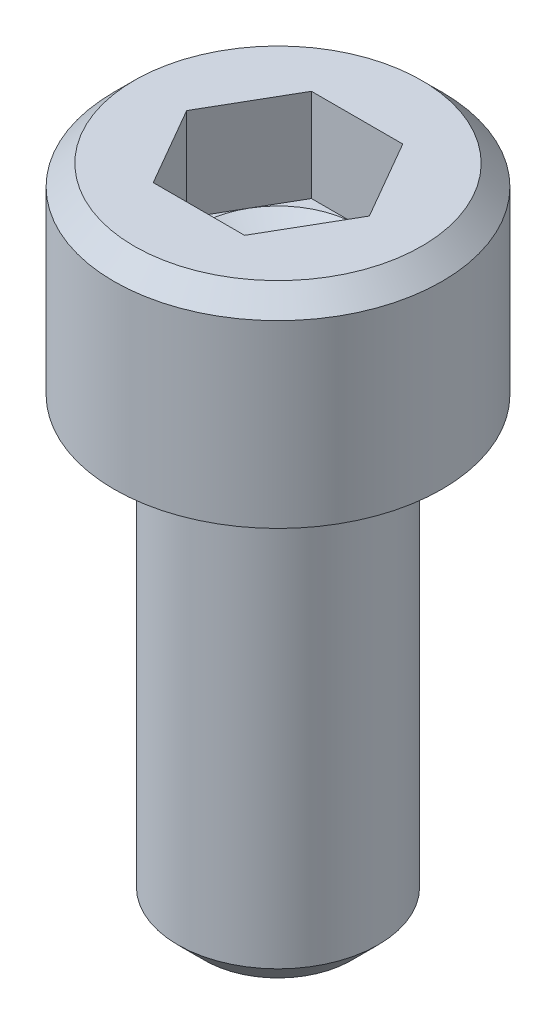
ISO-10303-21;
HEADER;
FILE_DESCRIPTION(('STEP AP214'),'2;1');
FILE_NAME('part.step','',(''),(''),'','','');
FILE_SCHEMA(('AUTOMOTIVE_DESIGN { 1 0 10303 214 1 1 1 1 }'));
ENDSEC;
DATA;
#1=APPLICATION_CONTEXT('core data for automotive mechanical design processes');
#2=APPLICATION_PROTOCOL_DEFINITION('international standard','automotive_design',2000,#1);
#3=PRODUCT_CONTEXT('',#1,'mechanical');
#4=PRODUCT('Part','Part','',(#3));
#5=PRODUCT_RELATED_PRODUCT_CATEGORY('part','',(#4));
#6=PRODUCT_DEFINITION_FORMATION('','',#4);
#7=PRODUCT_DEFINITION_CONTEXT('part definition',#1,'design');
#8=PRODUCT_DEFINITION('design','',#6,#7);
#9=PRODUCT_DEFINITION_SHAPE('','',#8);
#10=(LENGTH_UNIT() NAMED_UNIT(*) SI_UNIT(.MILLI.,.METRE.));
#11=(NAMED_UNIT(*) PLANE_ANGLE_UNIT() SI_UNIT($,.RADIAN.));
#12=(NAMED_UNIT(*) SI_UNIT($,.STERADIAN.) SOLID_ANGLE_UNIT());
#13=UNCERTAINTY_MEASURE_WITH_UNIT(LENGTH_MEASURE(1.E-05),#10,'distance_accuracy_value','');
#14=(GEOMETRIC_REPRESENTATION_CONTEXT(3) GLOBAL_UNCERTAINTY_ASSIGNED_CONTEXT((#13)) GLOBAL_UNIT_ASSIGNED_CONTEXT((#10,
#11,#12)) REPRESENTATION_CONTEXT('',''));
#15=CARTESIAN_POINT('',(0.,0.,0.));
#16=DIRECTION('',(0.,0.,1.));
#17=DIRECTION('',(1.,0.,0.));
#18=AXIS2_PLACEMENT_3D('',#15,#16,#17);
#19=CARTESIAN_POINT('',(0.,1.8796,0.));
#20=DIRECTION('',(0.,1.,0.));
#21=DIRECTION('',(0.,0.,1.));
#22=AXIS2_PLACEMENT_3D('',#19,#20,#21);
#23=PLANE('',#22);
#24=DIRECTION('',(0.5,0.,-0.866025403784439));
#25=VECTOR('',#24,1.);
#26=CARTESIAN_POINT('',(0.799225977639064,1.8796,1.38429999999992));
#27=LINE('',#26,#25);
#28=CARTESIAN_POINT('',(0.799225977639064,1.8796,1.38429999999992));
#29=VERTEX_POINT('',#28);
#30=CARTESIAN_POINT('',(1.19883896645866,1.87960000005181,0.692149999999922));
#31=VERTEX_POINT('',#30);
#32=EDGE_CURVE('E159',#29,#31,#27,.T.);
#33=ORIENTED_EDGE('',*,*,#32,.T.);
#34=CARTESIAN_POINT('',(0.,1.87960000005181,0.));
#35=DIRECTION('',(0.,-1.,0.));
#36=DIRECTION('',(1.,0.,0.));
#37=AXIS2_PLACEMENT_3D('',#34,#35,#36);
#38=CIRCLE('',#37,1.38429999998393);
#39=CARTESIAN_POINT('',(0.,1.87960000005181,1.38429999998393));
#40=VERTEX_POINT('',#39);
#41=EDGE_CURVE('E47',#31,#40,#38,.T.);
#42=ORIENTED_EDGE('',*,*,#41,.T.);
#43=DIRECTION('',(1.,0.,0.));
#44=VECTOR('',#43,1.);
#45=CARTESIAN_POINT('',(-0.799225977639255,1.8796,1.38429999999992));
#46=LINE('',#45,#44);
#47=EDGE_CURVE('E189',#40,#29,#46,.T.);
#48=ORIENTED_EDGE('',*,*,#47,.T.);
#49=EDGE_LOOP('',(#33,#42,#48));
#50=FACE_BOUND('',#49,.T.);
#51=ADVANCED_FACE('F32',(#50),#23,.T.);
#52=CARTESIAN_POINT('',(-0.799225977639255,1.8796,1.38429999999992));
#53=VERTEX_POINT('',#52);
#54=EDGE_CURVE('E279',#53,#40,#46,.T.);
#55=ORIENTED_EDGE('',*,*,#54,.T.);
#56=CARTESIAN_POINT('',(-1.19883896644491,1.87960000005181,0.692149999991913));
#57=VERTEX_POINT('',#56);
#58=EDGE_CURVE('E208',#40,#57,#38,.T.);
#59=ORIENTED_EDGE('',*,*,#58,.T.);
#60=DIRECTION('',(0.499999999999962,0.,0.866025403784461));
#61=VECTOR('',#60,1.);
#62=CARTESIAN_POINT('',(-1.59845195527835,1.8796,0.));
#63=LINE('',#62,#61);
#64=EDGE_CURVE('E168',#57,#53,#63,.T.);
#65=ORIENTED_EDGE('',*,*,#64,.T.);
#66=EDGE_LOOP('',(#55,#59,#65));
#67=FACE_BOUND('',#66,.T.);
#68=ADVANCED_FACE('F122',(#67),#23,.T.);
#69=CARTESIAN_POINT('',(-1.59845195527835,1.8796,0.));
#70=VERTEX_POINT('',#69);
#71=EDGE_CURVE('E169',#70,#57,#63,.T.);
#72=ORIENTED_EDGE('',*,*,#71,.T.);
#73=CARTESIAN_POINT('',(-1.19883896644488,1.87960000005181,-0.692149999991966));
#74=VERTEX_POINT('',#73);
#75=EDGE_CURVE('E282',#57,#74,#38,.T.);
#76=ORIENTED_EDGE('',*,*,#75,.T.);
#77=DIRECTION('',(-0.5,0.,0.866025403784439));
#78=VECTOR('',#77,1.);
#79=CARTESIAN_POINT('',(-0.799225977639255,1.8796,-1.38429999999987));
#80=LINE('',#79,#78);
#81=EDGE_CURVE('E164',#74,#70,#80,.T.);
#82=ORIENTED_EDGE('',*,*,#81,.T.);
#83=EDGE_LOOP('',(#72,#76,#82));
#84=FACE_BOUND('',#83,.T.);
#85=ADVANCED_FACE('F128',(#84),#23,.T.);
#86=CARTESIAN_POINT('',(-0.799225977639255,1.8796,-1.38429999999987));
#87=VERTEX_POINT('',#86);
#88=EDGE_CURVE('E165',#87,#74,#80,.T.);
#89=ORIENTED_EDGE('',*,*,#88,.T.);
#90=CARTESIAN_POINT('',(0.,1.87960000005181,-1.38429999998393));
#91=VERTEX_POINT('',#90);
#92=EDGE_CURVE('E285',#74,#91,#38,.T.);
#93=ORIENTED_EDGE('',*,*,#92,.T.);
#94=DIRECTION('',(-1.,0.,0.));
#95=VECTOR('',#94,1.);
#96=CARTESIAN_POINT('',(0.799225977638982,1.8796,-1.38429999999987));
#97=LINE('',#96,#95);
#98=EDGE_CURVE('E154',#91,#87,#97,.T.);
#99=ORIENTED_EDGE('',*,*,#98,.T.);
#100=EDGE_LOOP('',(#89,#93,#99));
#101=FACE_BOUND('',#100,.T.);
#102=ADVANCED_FACE('F143',(#101),#23,.T.);
#103=CARTESIAN_POINT('',(0.799225977638982,1.8796,-1.38429999999987));
#104=VERTEX_POINT('',#103);
#105=EDGE_CURVE('E157',#104,#91,#97,.T.);
#106=ORIENTED_EDGE('',*,*,#105,.T.);
#107=CARTESIAN_POINT('',(1.19883896644488,1.87960000005181,-0.692149999991966));
#108=VERTEX_POINT('',#107);
#109=EDGE_CURVE('E283',#91,#108,#38,.T.);
#110=ORIENTED_EDGE('',*,*,#109,.T.);
#111=DIRECTION('',(-0.5,0.,-0.866025403784439));
#112=VECTOR('',#111,1.);
#113=CARTESIAN_POINT('',(1.59845195527816,1.8796,0.));
#114=LINE('',#113,#112);
#115=EDGE_CURVE('E155',#108,#104,#114,.T.);
#116=ORIENTED_EDGE('',*,*,#115,.T.);
#117=EDGE_LOOP('',(#106,#110,#116));
#118=FACE_BOUND('',#117,.T.);
#119=ADVANCED_FACE('F134',(#118),#23,.T.);
#120=CARTESIAN_POINT('',(1.59845195527816,1.8796,0.));
#121=VERTEX_POINT('',#120);
#122=EDGE_CURVE('E147',#121,#108,#114,.T.);
#123=ORIENTED_EDGE('',*,*,#122,.T.);
#124=EDGE_CURVE('E148',#108,#31,#38,.T.);
#125=ORIENTED_EDGE('',*,*,#124,.T.);
#126=EDGE_CURVE('E150',#31,#121,#27,.T.);
#127=ORIENTED_EDGE('',*,*,#126,.T.);
#128=EDGE_LOOP('',(#123,#125,#127));
#129=FACE_BOUND('',#128,.T.);
#130=ADVANCED_FACE('F124',(#129),#23,.T.);
#131=CARTESIAN_POINT('',(0.,0.,0.));
#132=DIRECTION('',(0.,-1.,0.));
#133=DIRECTION('',(0.,0.,-1.));
#134=AXIS2_PLACEMENT_3D('',#131,#132,#133);
#135=PLANE('',#134);
#136=CARTESIAN_POINT('',(0.,0.,0.));
#137=DIRECTION('',(0.,-1.,0.));
#138=DIRECTION('',(0.,0.,-1.));
#139=AXIS2_PLACEMENT_3D('',#136,#137,#138);
#140=CIRCLE('',#139,2.0066);
#141=CARTESIAN_POINT('',(0.,0.,-2.0066));
#142=VERTEX_POINT('',#141);
#143=EDGE_CURVE('E11',#142,#142,#140,.F.);
#144=ORIENTED_EDGE('',*,*,#143,.T.);
#145=EDGE_LOOP('',(#144));
#146=FACE_BOUND('',#145,.T.);
#147=CARTESIAN_POINT('',(0.,0.,0.));
#148=DIRECTION('',(0.,-1.,0.));
#149=DIRECTION('',(0.,0.,-1.));
#150=AXIS2_PLACEMENT_3D('',#147,#148,#149);
#151=CIRCLE('',#150,2.8702);
#152=CARTESIAN_POINT('',(0.,0.,-2.8702));
#153=VERTEX_POINT('',#152);
#154=EDGE_CURVE('E192',#153,#153,#151,.T.);
#155=ORIENTED_EDGE('',*,*,#154,.T.);
#156=EDGE_LOOP('',(#155));
#157=FACE_BOUND('',#156,.T.);
#158=ADVANCED_FACE('F133',(#146,#157),#135,.T.);
#159=CARTESIAN_POINT('',(0.,3.5052,0.));
#160=DIRECTION('',(0.,-1.,0.));
#161=DIRECTION('',(0.,0.,-1.));
#162=AXIS2_PLACEMENT_3D('',#159,#160,#161);
#163=CYLINDRICAL_SURFACE('',#162,2.8702);
#164=CARTESIAN_POINT('',(0.,3.14959999998844,0.));
#165=DIRECTION('',(0.,1.,0.));
#166=DIRECTION('',(0.,0.,1.));
#167=AXIS2_PLACEMENT_3D('',#164,#165,#166);
#168=CIRCLE('',#167,2.8702);
#169=CARTESIAN_POINT('',(0.,3.14959999998844,2.8702));
#170=VERTEX_POINT('',#169);
#171=EDGE_CURVE('E211',#170,#170,#168,.F.);
#172=ORIENTED_EDGE('',*,*,#171,.T.);
#173=EDGE_LOOP('',(#172));
#174=FACE_BOUND('',#173,.T.);
#175=ORIENTED_EDGE('',*,*,#154,.F.);
#176=EDGE_LOOP('',(#175));
#177=FACE_BOUND('',#176,.T.);
#178=ADVANCED_FACE('F140',(#174,#177),#163,.T.);
#179=CARTESIAN_POINT('',(2.8702,3.5052,0.));
#180=DIRECTION('',(0.,1.,0.));
#181=DIRECTION('',(0.,0.,1.));
#182=AXIS2_PLACEMENT_3D('',#179,#180,#181);
#183=PLANE('',#182);
#184=CARTESIAN_POINT('',(0.,3.5052,0.));
#185=DIRECTION('',(0.,1.,0.));
#186=DIRECTION('',(0.,0.,1.));
#187=AXIS2_PLACEMENT_3D('',#184,#185,#186);
#188=CIRCLE('',#187,2.51459999998843);
#189=CARTESIAN_POINT('',(0.,3.5052,2.51459999998843));
#190=VERTEX_POINT('',#189);
#191=EDGE_CURVE('E214',#190,#190,#188,.T.);
#192=ORIENTED_EDGE('',*,*,#191,.T.);
#193=EDGE_LOOP('',(#192));
#194=FACE_BOUND('',#193,.T.);
#195=DIRECTION('',(1.,0.,0.));
#196=VECTOR('',#195,1.);
#197=CARTESIAN_POINT('',(-0.799225977639255,3.5052,1.38429999999992));
#198=LINE('',#197,#196);
#199=CARTESIAN_POINT('',(-0.799225977639255,3.5052,1.38429999999992));
#200=VERTEX_POINT('',#199);
#201=CARTESIAN_POINT('',(0.799225977639064,3.5052,1.38429999999992));
#202=VERTEX_POINT('',#201);
#203=EDGE_CURVE('E55',#200,#202,#198,.T.);
#204=ORIENTED_EDGE('',*,*,#203,.F.);
#205=DIRECTION('',(0.499999999999962,0.,0.866025403784461));
#206=VECTOR('',#205,1.);
#207=CARTESIAN_POINT('',(-1.59845195527835,3.5052,0.));
#208=LINE('',#207,#206);
#209=CARTESIAN_POINT('',(-1.59845195527835,3.5052,0.));
#210=VERTEX_POINT('',#209);
#211=EDGE_CURVE('E186',#210,#200,#208,.T.);
#212=ORIENTED_EDGE('',*,*,#211,.F.);
#213=DIRECTION('',(-0.5,0.,0.866025403784439));
#214=VECTOR('',#213,1.);
#215=CARTESIAN_POINT('',(-0.799225977639255,3.5052,-1.38429999999987));
#216=LINE('',#215,#214);
#217=CARTESIAN_POINT('',(-0.799225977639255,3.5052,-1.38429999999987));
#218=VERTEX_POINT('',#217);
#219=EDGE_CURVE('E183',#218,#210,#216,.T.);
#220=ORIENTED_EDGE('',*,*,#219,.F.);
#221=DIRECTION('',(-1.,0.,0.));
#222=VECTOR('',#221,1.);
#223=CARTESIAN_POINT('',(0.799225977638982,3.5052,-1.38429999999987));
#224=LINE('',#223,#222);
#225=CARTESIAN_POINT('',(0.799225977638982,3.5052,-1.38429999999987));
#226=VERTEX_POINT('',#225);
#227=EDGE_CURVE('E180',#226,#218,#224,.T.);
#228=ORIENTED_EDGE('',*,*,#227,.F.);
#229=DIRECTION('',(-0.5,0.,-0.866025403784439));
#230=VECTOR('',#229,1.);
#231=CARTESIAN_POINT('',(1.59845195527816,3.5052,0.));
#232=LINE('',#231,#230);
#233=CARTESIAN_POINT('',(1.59845195527816,3.5052,0.));
#234=VERTEX_POINT('',#233);
#235=EDGE_CURVE('E177',#234,#226,#232,.T.);
#236=ORIENTED_EDGE('',*,*,#235,.F.);
#237=DIRECTION('',(0.5,0.,-0.866025403784439));
#238=VECTOR('',#237,1.);
#239=CARTESIAN_POINT('',(0.799225977639064,3.5052,1.38429999999992));
#240=LINE('',#239,#238);
#241=EDGE_CURVE('E174',#202,#234,#240,.T.);
#242=ORIENTED_EDGE('',*,*,#241,.F.);
#243=EDGE_LOOP('',(#204,#212,#220,#228,#236,#242));
#244=FACE_BOUND('',#243,.T.);
#245=ADVANCED_FACE('F233',(#194,#244),#183,.T.);
#246=CARTESIAN_POINT('',(0.,-7.9375,0.));
#247=DIRECTION('',(0.,1.,0.));
#248=DIRECTION('',(0.,0.,1.));
#249=AXIS2_PLACEMENT_3D('',#246,#247,#248);
#250=CYLINDRICAL_SURFACE('',#249,1.7526);
#251=CARTESIAN_POINT('',(0.,-0.254,0.));
#252=DIRECTION('',(0.,-1.,0.));
#253=DIRECTION('',(0.,0.,-1.));
#254=AXIS2_PLACEMENT_3D('',#251,#252,#253);
#255=CIRCLE('',#254,1.7526);
#256=CARTESIAN_POINT('',(0.,-0.254,-1.7526));
#257=VERTEX_POINT('',#256);
#258=EDGE_CURVE('E40',#257,#257,#255,.T.);
#259=ORIENTED_EDGE('',*,*,#258,.T.);
#260=EDGE_LOOP('',(#259));
#261=FACE_BOUND('',#260,.T.);
#262=CARTESIAN_POINT('',(0.,-7.46505999996966,0.));
#263=DIRECTION('',(0.,-1.,0.));
#264=DIRECTION('',(0.,0.,-1.));
#265=AXIS2_PLACEMENT_3D('',#262,#263,#264);
#266=CIRCLE('',#265,1.7526);
#267=CARTESIAN_POINT('',(0.,-7.46505999996966,-1.7526));
#268=VERTEX_POINT('',#267);
#269=EDGE_CURVE('E207',#268,#268,#266,.F.);
#270=ORIENTED_EDGE('',*,*,#269,.T.);
#271=EDGE_LOOP('',(#270));
#272=FACE_BOUND('',#271,.T.);
#273=ADVANCED_FACE('F219',(#261,#272),#250,.T.);
#274=CARTESIAN_POINT('',(0.,-7.9375,0.));
#275=DIRECTION('',(0.,-1.,0.));
#276=DIRECTION('',(0.,0.,-1.));
#277=AXIS2_PLACEMENT_3D('',#274,#275,#276);
#278=PLANE('',#277);
#279=CARTESIAN_POINT('',(0.,-7.9375,0.));
#280=DIRECTION('',(0.,-1.,0.));
#281=DIRECTION('',(0.,0.,-1.));
#282=AXIS2_PLACEMENT_3D('',#279,#280,#281);
#283=CIRCLE('',#282,1.28015999996966);
#284=CARTESIAN_POINT('',(0.,-7.9375,-1.28015999996966));
#285=VERTEX_POINT('',#284);
#286=EDGE_CURVE('E204',#285,#285,#283,.T.);
#287=ORIENTED_EDGE('',*,*,#286,.T.);
#288=EDGE_LOOP('',(#287));
#289=FACE_BOUND('',#288,.T.);
#290=ADVANCED_FACE('F244',(#289),#278,.T.);
#291=CARTESIAN_POINT('',(-0.799225977639255,1.8796,1.38429999999992));
#292=DIRECTION('',(0.,0.,1.));
#293=DIRECTION('',(1.,0.,0.));
#294=AXIS2_PLACEMENT_3D('',#291,#292,#293);
#295=PLANE('',#294);
#296=ORIENTED_EDGE('',*,*,#203,.T.);
#297=DIRECTION('',(0.,1.,0.));
#298=VECTOR('',#297,1.);
#299=CARTESIAN_POINT('',(0.799225977639064,1.8796,1.38429999999992));
#300=LINE('',#299,#298);
#301=EDGE_CURVE('E172',#29,#202,#300,.T.);
#302=ORIENTED_EDGE('',*,*,#301,.F.);
#303=ORIENTED_EDGE('',*,*,#47,.F.);
#304=ORIENTED_EDGE('',*,*,#54,.F.);
#305=DIRECTION('',(0.,1.,0.));
#306=VECTOR('',#305,1.);
#307=CARTESIAN_POINT('',(-0.799225977639255,1.8796,1.38429999999992));
#308=LINE('',#307,#306);
#309=EDGE_CURVE('E190',#53,#200,#308,.T.);
#310=ORIENTED_EDGE('',*,*,#309,.T.);
#311=EDGE_LOOP('',(#296,#302,#303,#304,#310));
#312=FACE_BOUND('',#311,.T.);
#313=ADVANCED_FACE('F247',(#312),#295,.F.);
#314=CARTESIAN_POINT('',(-1.59845195527835,1.8796,0.));
#315=DIRECTION('',(-0.866025403784461,0.,0.499999999999962));
#316=DIRECTION('',(0.499999999999962,0.,0.866025403784461));
#317=AXIS2_PLACEMENT_3D('',#314,#315,#316);
#318=PLANE('',#317);
#319=ORIENTED_EDGE('',*,*,#211,.T.);
#320=ORIENTED_EDGE('',*,*,#309,.F.);
#321=ORIENTED_EDGE('',*,*,#64,.F.);
#322=ORIENTED_EDGE('',*,*,#71,.F.);
#323=DIRECTION('',(0.,1.,0.));
#324=VECTOR('',#323,1.);
#325=CARTESIAN_POINT('',(-1.59845195527835,1.8796,0.));
#326=LINE('',#325,#324);
#327=EDGE_CURVE('E193',#70,#210,#326,.T.);
#328=ORIENTED_EDGE('',*,*,#327,.T.);
#329=EDGE_LOOP('',(#319,#320,#321,#322,#328));
#330=FACE_BOUND('',#329,.T.);
#331=ADVANCED_FACE('F250',(#330),#318,.F.);
#332=CARTESIAN_POINT('',(-0.799225977639255,1.8796,-1.38429999999987));
#333=DIRECTION('',(-0.866025403784439,0.,-0.5));
#334=DIRECTION('',(-0.5,0.,0.866025403784439));
#335=AXIS2_PLACEMENT_3D('',#332,#333,#334);
#336=PLANE('',#335);
#337=ORIENTED_EDGE('',*,*,#219,.T.);
#338=ORIENTED_EDGE('',*,*,#327,.F.);
#339=ORIENTED_EDGE('',*,*,#81,.F.);
#340=ORIENTED_EDGE('',*,*,#88,.F.);
#341=DIRECTION('',(0.,1.,0.));
#342=VECTOR('',#341,1.);
#343=CARTESIAN_POINT('',(-0.799225977639255,1.8796,-1.38429999999987));
#344=LINE('',#343,#342);
#345=EDGE_CURVE('E195',#87,#218,#344,.T.);
#346=ORIENTED_EDGE('',*,*,#345,.T.);
#347=EDGE_LOOP('',(#337,#338,#339,#340,#346));
#348=FACE_BOUND('',#347,.T.);
#349=ADVANCED_FACE('F257',(#348),#336,.F.);
#350=CARTESIAN_POINT('',(0.799225977638982,1.8796,-1.38429999999987));
#351=DIRECTION('',(0.,0.,-1.));
#352=DIRECTION('',(-1.,0.,0.));
#353=AXIS2_PLACEMENT_3D('',#350,#351,#352);
#354=PLANE('',#353);
#355=ORIENTED_EDGE('',*,*,#227,.T.);
#356=ORIENTED_EDGE('',*,*,#345,.F.);
#357=ORIENTED_EDGE('',*,*,#98,.F.);
#358=ORIENTED_EDGE('',*,*,#105,.F.);
#359=DIRECTION('',(0.,1.,0.));
#360=VECTOR('',#359,1.);
#361=CARTESIAN_POINT('',(0.799225977638982,1.8796,-1.38429999999987));
#362=LINE('',#361,#360);
#363=EDGE_CURVE('E197',#104,#226,#362,.T.);
#364=ORIENTED_EDGE('',*,*,#363,.T.);
#365=EDGE_LOOP('',(#355,#356,#357,#358,#364));
#366=FACE_BOUND('',#365,.T.);
#367=ADVANCED_FACE('F254',(#366),#354,.F.);
#368=CARTESIAN_POINT('',(1.59845195527816,1.8796,0.));
#369=DIRECTION('',(0.866025403784439,0.,-0.5));
#370=DIRECTION('',(-0.5,0.,-0.866025403784439));
#371=AXIS2_PLACEMENT_3D('',#368,#369,#370);
#372=PLANE('',#371);
#373=ORIENTED_EDGE('',*,*,#235,.T.);
#374=ORIENTED_EDGE('',*,*,#363,.F.);
#375=ORIENTED_EDGE('',*,*,#115,.F.);
#376=ORIENTED_EDGE('',*,*,#122,.F.);
#377=DIRECTION('',(0.,1.,0.));
#378=VECTOR('',#377,1.);
#379=CARTESIAN_POINT('',(1.59845195527816,1.8796,0.));
#380=LINE('',#379,#378);
#381=EDGE_CURVE('E199',#121,#234,#380,.T.);
#382=ORIENTED_EDGE('',*,*,#381,.T.);
#383=EDGE_LOOP('',(#373,#374,#375,#376,#382));
#384=FACE_BOUND('',#383,.T.);
#385=ADVANCED_FACE('F117',(#384),#372,.F.);
#386=CARTESIAN_POINT('',(0.799225977639064,1.8796,1.38429999999992));
#387=DIRECTION('',(0.866025403784439,0.,0.5));
#388=DIRECTION('',(0.5,0.,-0.866025403784439));
#389=AXIS2_PLACEMENT_3D('',#386,#387,#388);
#390=PLANE('',#389);
#391=ORIENTED_EDGE('',*,*,#241,.T.);
#392=ORIENTED_EDGE('',*,*,#381,.F.);
#393=ORIENTED_EDGE('',*,*,#126,.F.);
#394=ORIENTED_EDGE('',*,*,#32,.F.);
#395=ORIENTED_EDGE('',*,*,#301,.T.);
#396=EDGE_LOOP('',(#391,#392,#393,#394,#395));
#397=FACE_BOUND('',#396,.T.);
#398=ADVANCED_FACE('F108',(#397),#390,.F.);
#399=CARTESIAN_POINT('',(0.,1.08037402242189,0.));
#400=DIRECTION('',(0.,1.,0.));
#401=DIRECTION('',(-1.,0.,0.));
#402=AXIS2_PLACEMENT_3D('',#399,#400,#401);
#403=CONICAL_SURFACE('',#402,0.,1.0471975511966);
#404=ORIENTED_EDGE('',*,*,#41,.F.);
#405=ORIENTED_EDGE('',*,*,#124,.F.);
#406=ORIENTED_EDGE('',*,*,#109,.F.);
#407=ORIENTED_EDGE('',*,*,#92,.F.);
#408=ORIENTED_EDGE('',*,*,#75,.F.);
#409=ORIENTED_EDGE('',*,*,#58,.F.);
#410=EDGE_LOOP('',(#404,#405,#406,#407,#408,#409));
#411=FACE_BOUND('',#410,.T.);
#412=CARTESIAN_POINT('',(0.,1.08037402242189,0.));
#413=VERTEX_POINT('',#412);
#414=VERTEX_LOOP('',#413);
#415=FACE_BOUND('',#414,.T.);
#416=ADVANCED_FACE('F105',(#411,#415),#403,.F.);
#417=CARTESIAN_POINT('',(0.,-7.9375,0.));
#418=DIRECTION('',(0.,1.,0.));
#419=DIRECTION('',(0.,0.,1.));
#420=AXIS2_PLACEMENT_3D('',#417,#418,#419);
#421=CONICAL_SURFACE('',#420,1.28015999996966,0.785398163397445);
#422=ORIENTED_EDGE('',*,*,#269,.F.);
#423=EDGE_LOOP('',(#422));
#424=FACE_BOUND('',#423,.T.);
#425=ORIENTED_EDGE('',*,*,#286,.F.);
#426=EDGE_LOOP('',(#425));
#427=FACE_BOUND('',#426,.T.);
#428=ADVANCED_FACE('F107',(#424,#427),#421,.T.);
#429=CARTESIAN_POINT('',(0.,3.14959999998844,0.));
#430=DIRECTION('',(0.,-1.,0.));
#431=DIRECTION('',(0.,0.,-1.));
#432=AXIS2_PLACEMENT_3D('',#429,#430,#431);
#433=CONICAL_SURFACE('',#432,2.8702,0.785398163397453);
#434=ORIENTED_EDGE('',*,*,#191,.F.);
#435=EDGE_LOOP('',(#434));
#436=FACE_BOUND('',#435,.T.);
#437=ORIENTED_EDGE('',*,*,#171,.F.);
#438=EDGE_LOOP('',(#437));
#439=FACE_BOUND('',#438,.T.);
#440=ADVANCED_FACE('F114',(#436,#439),#433,.T.);
#441=CARTESIAN_POINT('',(0.,-0.254,0.));
#442=DIRECTION('',(0.,-1.,0.));
#443=DIRECTION('',(0.,0.,-1.));
#444=AXIS2_PLACEMENT_3D('',#441,#442,#443);
#445=TOROIDAL_SURFACE('',#444,2.0066,0.254);
#446=ORIENTED_EDGE('',*,*,#143,.F.);
#447=EDGE_LOOP('',(#446));
#448=FACE_BOUND('',#447,.T.);
#449=ORIENTED_EDGE('',*,*,#258,.F.);
#450=EDGE_LOOP('',(#449));
#451=FACE_BOUND('',#450,.T.);
#452=ADVANCED_FACE('F34',(#448,#451),#445,.F.);
#453=CLOSED_SHELL('',(#51,#68,#85,#102,#119,#130,#158,#178,#245,#273,#290,#313,#331,#349,#367,
#385,#398,#416,#428,#440,#452));
#454=MANIFOLD_SOLID_BREP('B2',#453);
#455=ADVANCED_BREP_SHAPE_REPRESENTATION('',(#18,#454),#14);
#456=SHAPE_DEFINITION_REPRESENTATION(#9,#455);
ENDSEC;
END-ISO-10303-21;
